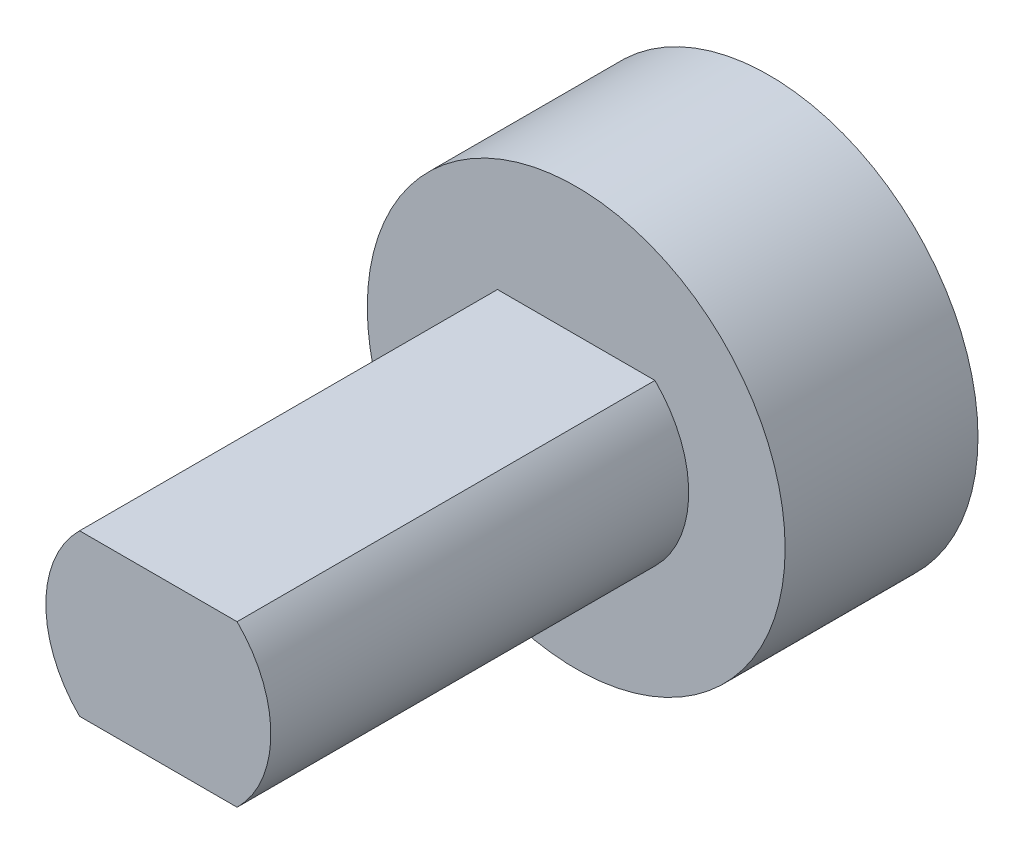
ISO-10303-21;
HEADER;
FILE_DESCRIPTION(('STEP AP214'),'2;1');
FILE_NAME('part.step','',(''),(''),'','','');
FILE_SCHEMA(('AUTOMOTIVE_DESIGN { 1 0 10303 214 1 1 1 1 }'));
ENDSEC;
DATA;
#1=APPLICATION_CONTEXT('core data for automotive mechanical design processes');
#2=APPLICATION_PROTOCOL_DEFINITION('international standard','automotive_design',2000,#1);
#3=PRODUCT_CONTEXT('',#1,'mechanical');
#4=PRODUCT('Part','Part','',(#3));
#5=PRODUCT_RELATED_PRODUCT_CATEGORY('part','',(#4));
#6=PRODUCT_DEFINITION_FORMATION('','',#4);
#7=PRODUCT_DEFINITION_CONTEXT('part definition',#1,'design');
#8=PRODUCT_DEFINITION('design','',#6,#7);
#9=PRODUCT_DEFINITION_SHAPE('','',#8);
#10=(LENGTH_UNIT() NAMED_UNIT(*) SI_UNIT(.MILLI.,.METRE.));
#11=(NAMED_UNIT(*) PLANE_ANGLE_UNIT() SI_UNIT($,.RADIAN.));
#12=(NAMED_UNIT(*) SI_UNIT($,.STERADIAN.) SOLID_ANGLE_UNIT());
#13=UNCERTAINTY_MEASURE_WITH_UNIT(LENGTH_MEASURE(1.E-05),#10,'distance_accuracy_value','');
#14=(GEOMETRIC_REPRESENTATION_CONTEXT(3) GLOBAL_UNCERTAINTY_ASSIGNED_CONTEXT((#13)) GLOBAL_UNIT_ASSIGNED_CONTEXT((#10,
#11,#12)) REPRESENTATION_CONTEXT('',''));
#15=CARTESIAN_POINT('',(0.,0.,0.));
#16=DIRECTION('',(0.,0.,1.));
#17=DIRECTION('',(1.,0.,0.));
#18=AXIS2_PLACEMENT_3D('',#15,#16,#17);
#19=CARTESIAN_POINT('',(0.,0.,6.));
#20=DIRECTION('',(0.,0.,-1.));
#21=DIRECTION('',(-1.,0.,0.));
#22=AXIS2_PLACEMENT_3D('',#19,#20,#21);
#23=CYLINDRICAL_SURFACE('',#22,6.5);
#24=CARTESIAN_POINT('',(0.,0.,6.));
#25=DIRECTION('',(0.,0.,1.));
#26=DIRECTION('',(1.,0.,0.));
#27=AXIS2_PLACEMENT_3D('',#24,#25,#26);
#28=CIRCLE('',#27,6.5);
#29=CARTESIAN_POINT('',(6.5,0.,6.));
#30=VERTEX_POINT('',#29);
#31=EDGE_CURVE('E11',#30,#30,#28,.T.);
#32=ORIENTED_EDGE('',*,*,#31,.F.);
#33=EDGE_LOOP('',(#32));
#34=FACE_BOUND('',#33,.T.);
#35=CARTESIAN_POINT('',(0.,0.,0.));
#36=DIRECTION('',(0.,0.,1.));
#37=DIRECTION('',(1.,0.,0.));
#38=AXIS2_PLACEMENT_3D('',#35,#36,#37);
#39=CIRCLE('',#38,6.5);
#40=CARTESIAN_POINT('',(6.5,0.,0.));
#41=VERTEX_POINT('',#40);
#42=EDGE_CURVE('E48',#41,#41,#39,.T.);
#43=ORIENTED_EDGE('',*,*,#42,.T.);
#44=EDGE_LOOP('',(#43));
#45=FACE_BOUND('',#44,.T.);
#46=ADVANCED_FACE('F45',(#34,#45),#23,.T.);
#47=CARTESIAN_POINT('',(0.,0.,6.));
#48=DIRECTION('',(0.,0.,1.));
#49=DIRECTION('',(1.,0.,0.));
#50=AXIS2_PLACEMENT_3D('',#47,#48,#49);
#51=PLANE('',#50);
#52=CARTESIAN_POINT('',(0.,0.,6.));
#53=DIRECTION('',(0.,0.,1.));
#54=DIRECTION('',(1.,0.,0.));
#55=AXIS2_PLACEMENT_3D('',#52,#53,#54);
#56=CIRCLE('',#55,3.5);
#57=CARTESIAN_POINT('',(2.44948974278318,-2.5,6.));
#58=VERTEX_POINT('',#57);
#59=CARTESIAN_POINT('',(2.44948974278318,2.5,6.));
#60=VERTEX_POINT('',#59);
#61=EDGE_CURVE('E60',#58,#60,#56,.T.);
#62=ORIENTED_EDGE('',*,*,#61,.F.);
#63=DIRECTION('',(1.,0.,0.));
#64=VECTOR('',#63,1.);
#65=CARTESIAN_POINT('',(-2.44948974278318,-2.5,6.));
#66=LINE('',#65,#64);
#67=CARTESIAN_POINT('',(-2.44948974278318,-2.5,6.));
#68=VERTEX_POINT('',#67);
#69=EDGE_CURVE('E64',#68,#58,#66,.T.);
#70=ORIENTED_EDGE('',*,*,#69,.F.);
#71=CARTESIAN_POINT('',(0.,0.,6.));
#72=DIRECTION('',(0.,0.,1.));
#73=DIRECTION('',(1.,0.,0.));
#74=AXIS2_PLACEMENT_3D('',#71,#72,#73);
#75=CIRCLE('',#74,3.5);
#76=CARTESIAN_POINT('',(-2.44948974278318,2.5,6.));
#77=VERTEX_POINT('',#76);
#78=EDGE_CURVE('E124',#77,#68,#75,.T.);
#79=ORIENTED_EDGE('',*,*,#78,.F.);
#80=DIRECTION('',(-1.,0.,0.));
#81=VECTOR('',#80,1.);
#82=CARTESIAN_POINT('',(-2.44948974278318,2.5,6.));
#83=LINE('',#82,#81);
#84=EDGE_CURVE('E127',#60,#77,#83,.T.);
#85=ORIENTED_EDGE('',*,*,#84,.F.);
#86=EDGE_LOOP('',(#62,#70,#79,#85));
#87=FACE_BOUND('',#86,.T.);
#88=ORIENTED_EDGE('',*,*,#31,.T.);
#89=EDGE_LOOP('',(#88));
#90=FACE_BOUND('',#89,.T.);
#91=ADVANCED_FACE('F156',(#87,#90),#51,.T.);
#92=CARTESIAN_POINT('',(0.,0.,0.));
#93=DIRECTION('',(0.,0.,1.));
#94=DIRECTION('',(1.,0.,0.));
#95=AXIS2_PLACEMENT_3D('',#92,#93,#94);
#96=PLANE('',#95);
#97=CARTESIAN_POINT('',(0.,0.,0.));
#98=DIRECTION('',(0.,0.,-1.));
#99=DIRECTION('',(-1.,0.,0.));
#100=AXIS2_PLACEMENT_3D('',#97,#98,#99);
#101=CIRCLE('',#100,1.5875);
#102=CARTESIAN_POINT('',(-1.5875,0.,0.));
#103=VERTEX_POINT('',#102);
#104=EDGE_CURVE('E137',#103,#103,#101,.T.);
#105=ORIENTED_EDGE('',*,*,#104,.F.);
#106=EDGE_LOOP('',(#105));
#107=FACE_BOUND('',#106,.T.);
#108=ORIENTED_EDGE('',*,*,#42,.F.);
#109=EDGE_LOOP('',(#108));
#110=FACE_BOUND('',#109,.T.);
#111=ADVANCED_FACE('F153',(#107,#110),#96,.F.);
#112=CARTESIAN_POINT('',(0.,0.,19.));
#113=DIRECTION('',(0.,0.,-1.));
#114=DIRECTION('',(-1.,0.,0.));
#115=AXIS2_PLACEMENT_3D('',#112,#113,#114);
#116=CYLINDRICAL_SURFACE('',#115,3.5);
#117=ORIENTED_EDGE('',*,*,#61,.T.);
#118=DIRECTION('',(0.,0.,-1.));
#119=VECTOR('',#118,1.);
#120=CARTESIAN_POINT('',(2.44948974278318,2.5,19.));
#121=LINE('',#120,#119);
#122=CARTESIAN_POINT('',(2.44948974278318,2.5,19.));
#123=VERTEX_POINT('',#122);
#124=EDGE_CURVE('E89',#123,#60,#121,.T.);
#125=ORIENTED_EDGE('',*,*,#124,.F.);
#126=CARTESIAN_POINT('',(0.,0.,19.));
#127=DIRECTION('',(0.,0.,1.));
#128=DIRECTION('',(1.,0.,0.));
#129=AXIS2_PLACEMENT_3D('',#126,#127,#128);
#130=CIRCLE('',#129,3.5);
#131=CARTESIAN_POINT('',(2.44948974278318,-2.5,19.));
#132=VERTEX_POINT('',#131);
#133=EDGE_CURVE('E96',#132,#123,#130,.T.);
#134=ORIENTED_EDGE('',*,*,#133,.F.);
#135=DIRECTION('',(0.,0.,-1.));
#136=VECTOR('',#135,1.);
#137=CARTESIAN_POINT('',(2.44948974278318,-2.5,19.));
#138=LINE('',#137,#136);
#139=EDGE_CURVE('E119',#132,#58,#138,.T.);
#140=ORIENTED_EDGE('',*,*,#139,.T.);
#141=EDGE_LOOP('',(#117,#125,#134,#140));
#142=FACE_BOUND('',#141,.T.);
#143=ADVANCED_FACE('F107',(#142),#116,.T.);
#144=CARTESIAN_POINT('',(-2.44948974278318,2.5,19.));
#145=DIRECTION('',(0.,-1.,0.));
#146=DIRECTION('',(0.,0.,-1.));
#147=AXIS2_PLACEMENT_3D('',#144,#145,#146);
#148=PLANE('',#147);
#149=ORIENTED_EDGE('',*,*,#84,.T.);
#150=DIRECTION('',(0.,0.,-1.));
#151=VECTOR('',#150,1.);
#152=CARTESIAN_POINT('',(-2.44948974278318,2.5,19.));
#153=LINE('',#152,#151);
#154=CARTESIAN_POINT('',(-2.44948974278318,2.5,19.));
#155=VERTEX_POINT('',#154);
#156=EDGE_CURVE('E91',#155,#77,#153,.T.);
#157=ORIENTED_EDGE('',*,*,#156,.F.);
#158=DIRECTION('',(-1.,0.,0.));
#159=VECTOR('',#158,1.);
#160=CARTESIAN_POINT('',(-2.44948974278318,2.5,19.));
#161=LINE('',#160,#159);
#162=EDGE_CURVE('E84',#123,#155,#161,.T.);
#163=ORIENTED_EDGE('',*,*,#162,.F.);
#164=ORIENTED_EDGE('',*,*,#124,.T.);
#165=EDGE_LOOP('',(#149,#157,#163,#164));
#166=FACE_BOUND('',#165,.T.);
#167=ADVANCED_FACE('F87',(#166),#148,.F.);
#168=CARTESIAN_POINT('',(0.,0.,19.));
#169=DIRECTION('',(0.,0.,-1.));
#170=DIRECTION('',(-1.,0.,0.));
#171=AXIS2_PLACEMENT_3D('',#168,#169,#170);
#172=CYLINDRICAL_SURFACE('',#171,3.5);
#173=ORIENTED_EDGE('',*,*,#78,.T.);
#174=DIRECTION('',(0.,0.,-1.));
#175=VECTOR('',#174,1.);
#176=CARTESIAN_POINT('',(-2.44948974278318,-2.5,19.));
#177=LINE('',#176,#175);
#178=CARTESIAN_POINT('',(-2.44948974278318,-2.5,19.));
#179=VERTEX_POINT('',#178);
#180=EDGE_CURVE('E113',#179,#68,#177,.T.);
#181=ORIENTED_EDGE('',*,*,#180,.F.);
#182=CARTESIAN_POINT('',(0.,0.,19.));
#183=DIRECTION('',(0.,0.,1.));
#184=DIRECTION('',(1.,0.,0.));
#185=AXIS2_PLACEMENT_3D('',#182,#183,#184);
#186=CIRCLE('',#185,3.5);
#187=EDGE_CURVE('E95',#155,#179,#186,.T.);
#188=ORIENTED_EDGE('',*,*,#187,.F.);
#189=ORIENTED_EDGE('',*,*,#156,.T.);
#190=EDGE_LOOP('',(#173,#181,#188,#189));
#191=FACE_BOUND('',#190,.T.);
#192=ADVANCED_FACE('F174',(#191),#172,.T.);
#193=CARTESIAN_POINT('',(-2.44948974278318,-2.5,19.));
#194=DIRECTION('',(0.,1.,0.));
#195=DIRECTION('',(0.,0.,1.));
#196=AXIS2_PLACEMENT_3D('',#193,#194,#195);
#197=PLANE('',#196);
#198=ORIENTED_EDGE('',*,*,#69,.T.);
#199=ORIENTED_EDGE('',*,*,#139,.F.);
#200=DIRECTION('',(1.,0.,0.));
#201=VECTOR('',#200,1.);
#202=CARTESIAN_POINT('',(-2.44948974278318,-2.5,19.));
#203=LINE('',#202,#201);
#204=EDGE_CURVE('E101',#179,#132,#203,.T.);
#205=ORIENTED_EDGE('',*,*,#204,.F.);
#206=ORIENTED_EDGE('',*,*,#180,.T.);
#207=EDGE_LOOP('',(#198,#199,#205,#206));
#208=FACE_BOUND('',#207,.T.);
#209=ADVANCED_FACE('F177',(#208),#197,.F.);
#210=CARTESIAN_POINT('',(0.,0.,19.));
#211=DIRECTION('',(0.,0.,1.));
#212=DIRECTION('',(1.,0.,0.));
#213=AXIS2_PLACEMENT_3D('',#210,#211,#212);
#214=PLANE('',#213);
#215=ORIENTED_EDGE('',*,*,#133,.T.);
#216=ORIENTED_EDGE('',*,*,#162,.T.);
#217=ORIENTED_EDGE('',*,*,#187,.T.);
#218=ORIENTED_EDGE('',*,*,#204,.T.);
#219=EDGE_LOOP('',(#215,#216,#217,#218));
#220=FACE_BOUND('',#219,.T.);
#221=ADVANCED_FACE('F99',(#220),#214,.T.);
#222=CARTESIAN_POINT('',(0.,0.,10.));
#223=DIRECTION('',(0.,0.,-1.));
#224=DIRECTION('',(-1.,0.,0.));
#225=AXIS2_PLACEMENT_3D('',#222,#223,#224);
#226=CYLINDRICAL_SURFACE('',#225,1.5875);
#227=CARTESIAN_POINT('',(0.,0.,10.));
#228=DIRECTION('',(0.,0.,-1.));
#229=DIRECTION('',(-1.,0.,0.));
#230=AXIS2_PLACEMENT_3D('',#227,#228,#229);
#231=CIRCLE('',#230,1.5875);
#232=CARTESIAN_POINT('',(-1.5875,0.,10.));
#233=VERTEX_POINT('',#232);
#234=EDGE_CURVE('E132',#233,#233,#231,.T.);
#235=ORIENTED_EDGE('',*,*,#234,.F.);
#236=EDGE_LOOP('',(#235));
#237=FACE_BOUND('',#236,.T.);
#238=ORIENTED_EDGE('',*,*,#104,.T.);
#239=EDGE_LOOP('',(#238));
#240=FACE_BOUND('',#239,.T.);
#241=ADVANCED_FACE('F147',(#237,#240),#226,.F.);
#242=CARTESIAN_POINT('',(0.,0.,10.));
#243=DIRECTION('',(0.,0.,-1.));
#244=DIRECTION('',(-1.,0.,0.));
#245=AXIS2_PLACEMENT_3D('',#242,#243,#244);
#246=PLANE('',#245);
#247=ORIENTED_EDGE('',*,*,#234,.T.);
#248=EDGE_LOOP('',(#247));
#249=FACE_BOUND('',#248,.T.);
#250=ADVANCED_FACE('F145',(#249),#246,.T.);
#251=CLOSED_SHELL('',(#46,#91,#111,#143,#167,#192,#209,#221,#241,#250));
#252=MANIFOLD_SOLID_BREP('B2',#251);
#253=ADVANCED_BREP_SHAPE_REPRESENTATION('',(#18,#252),#14);
#254=SHAPE_DEFINITION_REPRESENTATION(#9,#253);
ENDSEC;
END-ISO-10303-21;
